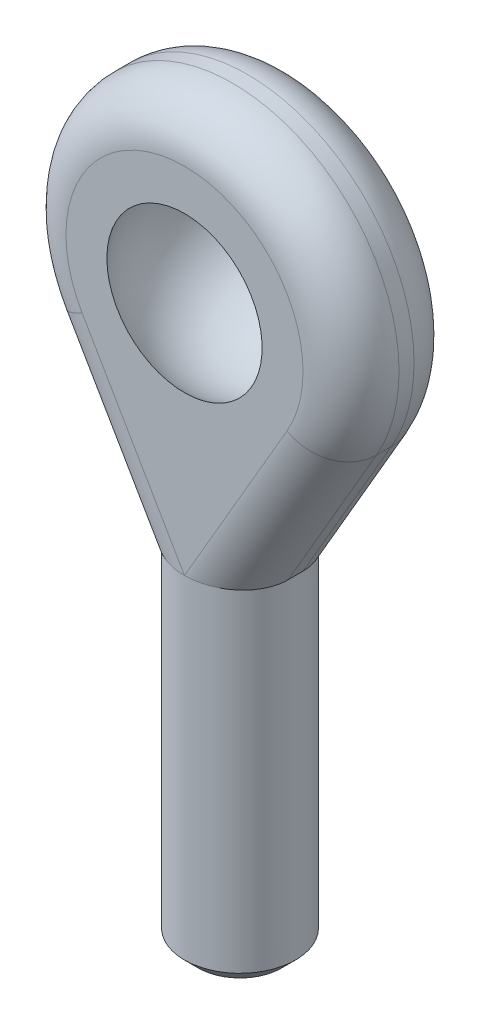
ISO-10303-21;
HEADER;
FILE_DESCRIPTION(('STEP AP214'),'2;1');
FILE_NAME('part.step','',(''),(''),'','','');
FILE_SCHEMA(('AUTOMOTIVE_DESIGN { 1 0 10303 214 1 1 1 1 }'));
ENDSEC;
DATA;
#1=APPLICATION_CONTEXT('core data for automotive mechanical design processes');
#2=APPLICATION_PROTOCOL_DEFINITION('international standard','automotive_design',2000,#1);
#3=PRODUCT_CONTEXT('',#1,'mechanical');
#4=PRODUCT('Part','Part','',(#3));
#5=PRODUCT_RELATED_PRODUCT_CATEGORY('part','',(#4));
#6=PRODUCT_DEFINITION_FORMATION('','',#4);
#7=PRODUCT_DEFINITION_CONTEXT('part definition',#1,'design');
#8=PRODUCT_DEFINITION('design','',#6,#7);
#9=PRODUCT_DEFINITION_SHAPE('','',#8);
#10=(LENGTH_UNIT() NAMED_UNIT(*) SI_UNIT(.MILLI.,.METRE.));
#11=(NAMED_UNIT(*) PLANE_ANGLE_UNIT() SI_UNIT($,.RADIAN.));
#12=(NAMED_UNIT(*) SI_UNIT($,.STERADIAN.) SOLID_ANGLE_UNIT());
#13=UNCERTAINTY_MEASURE_WITH_UNIT(LENGTH_MEASURE(1.E-05),#10,'distance_accuracy_value','');
#14=(GEOMETRIC_REPRESENTATION_CONTEXT(3) GLOBAL_UNCERTAINTY_ASSIGNED_CONTEXT((#13)) GLOBAL_UNIT_ASSIGNED_CONTEXT((#10,
#11,#12)) REPRESENTATION_CONTEXT('',''));
#15=CARTESIAN_POINT('',(0.,0.,0.));
#16=DIRECTION('',(0.,0.,1.));
#17=DIRECTION('',(1.,0.,0.));
#18=AXIS2_PLACEMENT_3D('',#15,#16,#17);
#19=CARTESIAN_POINT('',(0.,12.5,0.));
#20=DIRECTION('',(0.,-1.,0.));
#21=DIRECTION('',(0.,0.,-1.));
#22=AXIS2_PLACEMENT_3D('',#19,#20,#21);
#23=CYLINDRICAL_SURFACE('',#22,4.);
#24=CARTESIAN_POINT('',(0.,-11.5,0.));
#25=DIRECTION('',(0.,1.,0.));
#26=DIRECTION('',(0.,0.,1.));
#27=AXIS2_PLACEMENT_3D('',#24,#25,#26);
#28=CIRCLE('',#27,4.);
#29=CARTESIAN_POINT('',(0.,-11.5,4.));
#30=VERTEX_POINT('',#29);
#31=EDGE_CURVE('E156',#30,#30,#28,.T.);
#32=ORIENTED_EDGE('',*,*,#31,.T.);
#33=EDGE_LOOP('',(#32));
#34=FACE_BOUND('',#33,.T.);
#35=CARTESIAN_POINT('',(0.,12.5,0.));
#36=DIRECTION('',(0.,1.,0.));
#37=DIRECTION('',(0.,0.,1.));
#38=AXIS2_PLACEMENT_3D('',#35,#36,#37);
#39=CIRCLE('',#38,4.);
#40=CARTESIAN_POINT('',(0.,12.5,4.));
#41=VERTEX_POINT('',#40);
#42=CARTESIAN_POINT('',(4.2747447304662E-05,12.5,3.99999999988579));
#43=VERTEX_POINT('',#42);
#44=EDGE_CURVE('E171',#41,#43,#39,.T.);
#45=ORIENTED_EDGE('',*,*,#44,.F.);
#46=DIRECTION('',(1.,0.,0.));
#47=VECTOR('',#46,1.);
#48=CARTESIAN_POINT('',(4.,12.5,4.));
#49=LINE('',#48,#47);
#50=CARTESIAN_POINT('',(-4.27474473090107E-05,12.5,3.99999999988579));
#51=VERTEX_POINT('',#50);
#52=EDGE_CURVE('E241',#51,#41,#49,.T.);
#53=ORIENTED_EDGE('',*,*,#52,.F.);
#54=CARTESIAN_POINT('',(-4.,12.5,0.));
#55=VERTEX_POINT('',#54);
#56=EDGE_CURVE('E119',#55,#51,#39,.T.);
#57=ORIENTED_EDGE('',*,*,#56,.F.);
#58=CARTESIAN_POINT('',(-4.27474473081902E-05,12.5,-3.99999999988579));
#59=VERTEX_POINT('',#58);
#60=EDGE_CURVE('E152',#59,#55,#39,.T.);
#61=ORIENTED_EDGE('',*,*,#60,.F.);
#62=CARTESIAN_POINT('',(0.,12.5,-4.));
#63=VERTEX_POINT('',#62);
#64=EDGE_CURVE('E148',#63,#59,#39,.T.);
#65=ORIENTED_EDGE('',*,*,#64,.F.);
#66=DIRECTION('',(1.,0.,0.));
#67=VECTOR('',#66,1.);
#68=CARTESIAN_POINT('',(4.,12.5,-4.));
#69=LINE('',#68,#67);
#70=CARTESIAN_POINT('',(4.27474473056231E-05,12.5,-3.99999999988579));
#71=VERTEX_POINT('',#70);
#72=EDGE_CURVE('E226',#63,#71,#69,.T.);
#73=ORIENTED_EDGE('',*,*,#72,.T.);
#74=CARTESIAN_POINT('',(4.,12.5,0.));
#75=VERTEX_POINT('',#74);
#76=EDGE_CURVE('E151',#75,#71,#39,.T.);
#77=ORIENTED_EDGE('',*,*,#76,.F.);
#78=EDGE_CURVE('E174',#43,#75,#39,.T.);
#79=ORIENTED_EDGE('',*,*,#78,.F.);
#80=EDGE_LOOP('',(#45,#53,#57,#61,#65,#73,#77,#79));
#81=FACE_BOUND('',#80,.T.);
#82=ADVANCED_FACE('F43',(#34,#81),#23,.T.);
#83=CARTESIAN_POINT('',(0.,-12.5,0.));
#84=DIRECTION('',(0.,1.,0.));
#85=DIRECTION('',(0.,0.,1.));
#86=AXIS2_PLACEMENT_3D('',#83,#84,#85);
#87=PLANE('',#86);
#88=CARTESIAN_POINT('',(0.,-12.5,0.));
#89=DIRECTION('',(0.,1.,0.));
#90=DIRECTION('',(0.,0.,1.));
#91=AXIS2_PLACEMENT_3D('',#88,#89,#90);
#92=CIRCLE('',#91,3.);
#93=CARTESIAN_POINT('',(0.,-12.5,3.));
#94=VERTEX_POINT('',#93);
#95=EDGE_CURVE('E208',#94,#94,#92,.F.);
#96=ORIENTED_EDGE('',*,*,#95,.T.);
#97=EDGE_LOOP('',(#96));
#98=FACE_BOUND('',#97,.T.);
#99=ADVANCED_FACE('F288',(#98),#87,.F.);
#100=CARTESIAN_POINT('',(4.,12.5,4.));
#101=DIRECTION('',(0.,1.,0.));
#102=DIRECTION('',(-1.,0.,0.));
#103=AXIS2_PLACEMENT_3D('',#100,#101,#102);
#104=PLANE('',#103);
#105=DIRECTION('',(0.,0.,-1.));
#106=VECTOR('',#105,1.);
#107=CARTESIAN_POINT('',(4.,12.5,4.));
#108=LINE('',#107,#106);
#109=CARTESIAN_POINT('',(4.,12.5,0.5416));
#110=VERTEX_POINT('',#109);
#111=EDGE_CURVE('E247',#110,#75,#108,.T.);
#112=ORIENTED_EDGE('',*,*,#111,.F.);
#113=CARTESIAN_POINT('',(4.27474473041478E-05,12.5,0.5416));
#114=DIRECTION('',(0.,1.,0.));
#115=DIRECTION('',(1.,0.,0.));
#116=AXIS2_PLACEMENT_3D('',#113,#114,#115);
#117=ELLIPSE('',#116,3.99995725255269,3.4584);
#118=EDGE_CURVE('E11',#110,#43,#117,.F.);
#119=ORIENTED_EDGE('',*,*,#118,.T.);
#120=ORIENTED_EDGE('',*,*,#78,.T.);
#121=EDGE_LOOP('',(#112,#119,#120));
#122=FACE_BOUND('',#121,.T.);
#123=ADVANCED_FACE('F246',(#122),#104,.F.);
#124=ORIENTED_EDGE('',*,*,#76,.T.);
#125=CARTESIAN_POINT('',(4.27474473063162E-05,12.5,-0.5416));
#126=DIRECTION('',(0.,1.,0.));
#127=DIRECTION('',(-1.,0.,0.));
#128=AXIS2_PLACEMENT_3D('',#125,#126,#127);
#129=ELLIPSE('',#128,3.99995725255269,3.4584);
#130=CARTESIAN_POINT('',(4.,12.5,-0.5416));
#131=VERTEX_POINT('',#130);
#132=EDGE_CURVE('E86',#71,#131,#129,.F.);
#133=ORIENTED_EDGE('',*,*,#132,.T.);
#134=EDGE_CURVE('E251',#75,#131,#108,.T.);
#135=ORIENTED_EDGE('',*,*,#134,.F.);
#136=EDGE_LOOP('',(#124,#133,#135));
#137=FACE_BOUND('',#136,.T.);
#138=ADVANCED_FACE('F374',(#137),#104,.F.);
#139=DIRECTION('',(0.,0.,-1.));
#140=VECTOR('',#139,1.);
#141=CARTESIAN_POINT('',(-4.,12.5,4.));
#142=LINE('',#141,#140);
#143=CARTESIAN_POINT('',(-4.,12.5,-0.5416));
#144=VERTEX_POINT('',#143);
#145=EDGE_CURVE('E130',#55,#144,#142,.T.);
#146=ORIENTED_EDGE('',*,*,#145,.T.);
#147=CARTESIAN_POINT('',(-4.27474473102193E-05,12.5,-0.5416));
#148=DIRECTION('',(0.,1.,0.));
#149=DIRECTION('',(-1.,0.,0.));
#150=AXIS2_PLACEMENT_3D('',#147,#148,#149);
#151=ELLIPSE('',#150,3.99995725255269,3.4584);
#152=EDGE_CURVE('E53',#144,#59,#151,.F.);
#153=ORIENTED_EDGE('',*,*,#152,.T.);
#154=ORIENTED_EDGE('',*,*,#60,.T.);
#155=EDGE_LOOP('',(#146,#153,#154));
#156=FACE_BOUND('',#155,.T.);
#157=ADVANCED_FACE('F367',(#156),#104,.F.);
#158=ORIENTED_EDGE('',*,*,#56,.T.);
#159=CARTESIAN_POINT('',(-4.27474473102193E-05,12.5,0.5416));
#160=DIRECTION('',(0.,1.,0.));
#161=DIRECTION('',(1.,0.,0.));
#162=AXIS2_PLACEMENT_3D('',#159,#160,#161);
#163=ELLIPSE('',#162,3.99995725255269,3.4584);
#164=CARTESIAN_POINT('',(-4.,12.5,0.5416));
#165=VERTEX_POINT('',#164);
#166=EDGE_CURVE('E113',#51,#165,#163,.F.);
#167=ORIENTED_EDGE('',*,*,#166,.T.);
#168=EDGE_CURVE('E117',#165,#55,#142,.T.);
#169=ORIENTED_EDGE('',*,*,#168,.T.);
#170=EDGE_LOOP('',(#158,#167,#169));
#171=FACE_BOUND('',#170,.T.);
#172=ADVANCED_FACE('F115',(#171),#104,.F.);
#173=CARTESIAN_POINT('',(0.,29.5,4.));
#174=DIRECTION('',(0.,0.,-1.));
#175=DIRECTION('',(-1.,0.,0.));
#176=AXIS2_PLACEMENT_3D('',#173,#174,#175);
#177=CYLINDRICAL_SURFACE('',#176,12.);
#178=DIRECTION('',(0.,0.,-1.));
#179=VECTOR('',#178,1.);
#180=CARTESIAN_POINT('',(10.3753108795138,23.470661383415,4.));
#181=LINE('',#180,#179);
#182=CARTESIAN_POINT('',(10.3753108795138,23.470661383415,0.5416));
#183=VERTEX_POINT('',#182);
#184=CARTESIAN_POINT('',(10.3753108795138,23.470661383415,-0.5416));
#185=VERTEX_POINT('',#184);
#186=EDGE_CURVE('E254',#183,#185,#181,.T.);
#187=ORIENTED_EDGE('',*,*,#186,.T.);
#188=CARTESIAN_POINT('',(0.,29.5,-0.5416));
#189=DIRECTION('',(0.,0.,-1.));
#190=DIRECTION('',(-1.,0.,0.));
#191=AXIS2_PLACEMENT_3D('',#188,#189,#190);
#192=CIRCLE('',#191,12.);
#193=CARTESIAN_POINT('',(-10.3753108795138,23.470661383415,-0.5416));
#194=VERTEX_POINT('',#193);
#195=EDGE_CURVE('E218',#185,#194,#192,.F.);
#196=ORIENTED_EDGE('',*,*,#195,.T.);
#197=DIRECTION('',(0.,0.,-1.));
#198=VECTOR('',#197,1.);
#199=CARTESIAN_POINT('',(-10.3753108795138,23.470661383415,4.));
#200=LINE('',#199,#198);
#201=CARTESIAN_POINT('',(-10.3753108795138,23.470661383415,0.5416));
#202=VERTEX_POINT('',#201);
#203=EDGE_CURVE('E131',#202,#194,#200,.T.);
#204=ORIENTED_EDGE('',*,*,#203,.F.);
#205=CARTESIAN_POINT('',(0.,29.5,0.5416));
#206=DIRECTION('',(0.,0.,-1.));
#207=DIRECTION('',(-1.,0.,0.));
#208=AXIS2_PLACEMENT_3D('',#205,#206,#207);
#209=CIRCLE('',#208,12.);
#210=EDGE_CURVE('E195',#202,#183,#209,.T.);
#211=ORIENTED_EDGE('',*,*,#210,.T.);
#212=EDGE_LOOP('',(#187,#196,#204,#211));
#213=FACE_BOUND('',#212,.T.);
#214=ADVANCED_FACE('F354',(#213),#177,.T.);
#215=CARTESIAN_POINT('',(-10.3753108795138,23.470661383415,4.));
#216=DIRECTION('',(0.864609239959481,0.502444884715416,0.));
#217=DIRECTION('',(-0.502444884715416,0.864609239959481,0.));
#218=AXIS2_PLACEMENT_3D('',#215,#216,#217);
#219=PLANE('',#218);
#220=ORIENTED_EDGE('',*,*,#168,.F.);
#221=DIRECTION('',(0.502444884715416,-0.864609239959481,0.));
#222=VECTOR('',#221,1.);
#223=CARTESIAN_POINT('',(-10.3753108795138,23.470661383415,0.5416));
#224=LINE('',#223,#222);
#225=EDGE_CURVE('E128',#165,#202,#224,.F.);
#226=ORIENTED_EDGE('',*,*,#225,.T.);
#227=ORIENTED_EDGE('',*,*,#203,.T.);
#228=DIRECTION('',(0.502444884715416,-0.864609239959481,0.));
#229=VECTOR('',#228,1.);
#230=CARTESIAN_POINT('',(-4.,12.5,-0.5416));
#231=LINE('',#230,#229);
#232=EDGE_CURVE('E62',#194,#144,#231,.T.);
#233=ORIENTED_EDGE('',*,*,#232,.T.);
#234=ORIENTED_EDGE('',*,*,#145,.F.);
#235=EDGE_LOOP('',(#220,#226,#227,#233,#234));
#236=FACE_BOUND('',#235,.T.);
#237=ADVANCED_FACE('F127',(#236),#219,.F.);
#238=CARTESIAN_POINT('',(4.,12.5,4.));
#239=DIRECTION('',(-0.864609239959481,0.502444884715416,0.));
#240=DIRECTION('',(-0.502444884715416,-0.864609239959481,0.));
#241=AXIS2_PLACEMENT_3D('',#238,#239,#240);
#242=PLANE('',#241);
#243=ORIENTED_EDGE('',*,*,#134,.T.);
#244=DIRECTION('',(0.502444884715416,0.864609239959481,0.));
#245=VECTOR('',#244,1.);
#246=CARTESIAN_POINT('',(10.3753108795138,23.470661383415,-0.5416));
#247=LINE('',#246,#245);
#248=EDGE_CURVE('E145',#131,#185,#247,.T.);
#249=ORIENTED_EDGE('',*,*,#248,.T.);
#250=ORIENTED_EDGE('',*,*,#186,.F.);
#251=DIRECTION('',(0.502444884715416,0.864609239959481,0.));
#252=VECTOR('',#251,1.);
#253=CARTESIAN_POINT('',(4.,12.5,0.5416));
#254=LINE('',#253,#252);
#255=EDGE_CURVE('E203',#183,#110,#254,.F.);
#256=ORIENTED_EDGE('',*,*,#255,.T.);
#257=ORIENTED_EDGE('',*,*,#111,.T.);
#258=EDGE_LOOP('',(#243,#249,#250,#256,#257));
#259=FACE_BOUND('',#258,.T.);
#260=ADVANCED_FACE('F250',(#259),#242,.F.);
#261=CARTESIAN_POINT('',(0.,29.5,4.));
#262=DIRECTION('',(0.,0.,-1.));
#263=DIRECTION('',(-1.,0.,0.));
#264=AXIS2_PLACEMENT_3D('',#261,#262,#263);
#265=PLANE('',#264);
#266=CARTESIAN_POINT('',(0.,29.5,4.));
#267=DIRECTION('',(0.,0.,-1.));
#268=DIRECTION('',(-1.,0.,0.));
#269=AXIS2_PLACEMENT_3D('',#266,#267,#268);
#270=CIRCLE('',#269,5.5937465083788);
#271=CARTESIAN_POINT('',(-5.5937465083788,29.5,4.));
#272=VERTEX_POINT('',#271);
#273=EDGE_CURVE('E261',#272,#272,#270,.F.);
#274=ORIENTED_EDGE('',*,*,#273,.F.);
#275=EDGE_LOOP('',(#274));
#276=FACE_BOUND('',#275,.T.);
#277=CARTESIAN_POINT('',(0.,29.5,4.));
#278=DIRECTION('',(0.,0.,-1.));
#279=DIRECTION('',(-1.,0.,0.));
#280=AXIS2_PLACEMENT_3D('',#277,#278,#279);
#281=CIRCLE('',#280,8.5416);
#282=CARTESIAN_POINT('',(7.38514628403791,25.2083167727148,4.));
#283=VERTEX_POINT('',#282);
#284=CARTESIAN_POINT('',(-7.38514628403791,25.2083167727148,4.));
#285=VERTEX_POINT('',#284);
#286=EDGE_CURVE('E196',#283,#285,#281,.F.);
#287=ORIENTED_EDGE('',*,*,#286,.T.);
#288=DIRECTION('',(0.502444884715416,-0.864609239959481,0.));
#289=VECTOR('',#288,1.);
#290=CARTESIAN_POINT('',(-7.38514628403791,25.2083167727148,4.));
#291=LINE('',#290,#289);
#292=EDGE_CURVE('E125',#285,#51,#291,.T.);
#293=ORIENTED_EDGE('',*,*,#292,.T.);
#294=ORIENTED_EDGE('',*,*,#52,.T.);
#295=ORIENTED_EDGE('',*,*,#44,.T.);
#296=DIRECTION('',(0.502444884715416,0.864609239959481,0.));
#297=VECTOR('',#296,1.);
#298=CARTESIAN_POINT('',(7.38514628403791,25.2083167727148,4.));
#299=LINE('',#298,#297);
#300=EDGE_CURVE('E202',#43,#283,#299,.T.);
#301=ORIENTED_EDGE('',*,*,#300,.T.);
#302=EDGE_LOOP('',(#287,#293,#294,#295,#301));
#303=FACE_BOUND('',#302,.T.);
#304=ADVANCED_FACE('F236',(#276,#303),#265,.F.);
#305=CARTESIAN_POINT('',(0.,29.5,-4.));
#306=DIRECTION('',(0.,0.,-1.));
#307=DIRECTION('',(-1.,0.,0.));
#308=AXIS2_PLACEMENT_3D('',#305,#306,#307);
#309=PLANE('',#308);
#310=CARTESIAN_POINT('',(0.,29.5,-4.));
#311=DIRECTION('',(0.,0.,-1.));
#312=DIRECTION('',(-1.,0.,0.));
#313=AXIS2_PLACEMENT_3D('',#310,#311,#312);
#314=CIRCLE('',#313,5.59374650837879);
#315=CARTESIAN_POINT('',(-5.59374650837879,29.5,-4.));
#316=VERTEX_POINT('',#315);
#317=EDGE_CURVE('E186',#316,#316,#314,.F.);
#318=ORIENTED_EDGE('',*,*,#317,.T.);
#319=EDGE_LOOP('',(#318));
#320=FACE_BOUND('',#319,.T.);
#321=CARTESIAN_POINT('',(0.,29.5,-4.));
#322=DIRECTION('',(0.,0.,-1.));
#323=DIRECTION('',(-1.,0.,0.));
#324=AXIS2_PLACEMENT_3D('',#321,#322,#323);
#325=CIRCLE('',#324,8.5416);
#326=CARTESIAN_POINT('',(-7.38514628403791,25.2083167727148,-4.));
#327=VERTEX_POINT('',#326);
#328=CARTESIAN_POINT('',(7.38514628403791,25.2083167727148,-4.));
#329=VERTEX_POINT('',#328);
#330=EDGE_CURVE('E144',#327,#329,#325,.T.);
#331=ORIENTED_EDGE('',*,*,#330,.T.);
#332=DIRECTION('',(0.502444884715416,0.864609239959481,0.));
#333=VECTOR('',#332,1.);
#334=CARTESIAN_POINT('',(1.00983540452413,14.2376553892998,-4.));
#335=LINE('',#334,#333);
#336=EDGE_CURVE('E216',#329,#71,#335,.F.);
#337=ORIENTED_EDGE('',*,*,#336,.T.);
#338=ORIENTED_EDGE('',*,*,#72,.F.);
#339=ORIENTED_EDGE('',*,*,#64,.T.);
#340=DIRECTION('',(0.502444884715416,-0.864609239959481,0.));
#341=VECTOR('',#340,1.);
#342=CARTESIAN_POINT('',(-7.38514628403791,25.2083167727148,-4.));
#343=LINE('',#342,#341);
#344=EDGE_CURVE('E142',#59,#327,#343,.F.);
#345=ORIENTED_EDGE('',*,*,#344,.T.);
#346=EDGE_LOOP('',(#331,#337,#338,#339,#345));
#347=FACE_BOUND('',#346,.T.);
#348=ADVANCED_FACE('F270',(#320,#347),#309,.T.);
#349=CARTESIAN_POINT('',(0.,-11.5,0.));
#350=DIRECTION('',(0.,1.,0.));
#351=DIRECTION('',(0.,0.,1.));
#352=AXIS2_PLACEMENT_3D('',#349,#350,#351);
#353=CONICAL_SURFACE('',#352,4.,0.785398163397448);
#354=ORIENTED_EDGE('',*,*,#95,.F.);
#355=EDGE_LOOP('',(#354));
#356=FACE_BOUND('',#355,.T.);
#357=ORIENTED_EDGE('',*,*,#31,.F.);
#358=EDGE_LOOP('',(#357));
#359=FACE_BOUND('',#358,.T.);
#360=ADVANCED_FACE('F275',(#356,#359),#353,.T.);
#361=CARTESIAN_POINT('',(0.,29.5,0.));
#362=DIRECTION('',(0.,0.,1.));
#363=DIRECTION('',(0.,1.,0.));
#364=AXIS2_PLACEMENT_3D('',#361,#362,#363);
#365=SPHERICAL_SURFACE('',#364,6.87677249878168);
#366=ORIENTED_EDGE('',*,*,#317,.F.);
#367=EDGE_LOOP('',(#366));
#368=FACE_BOUND('',#367,.T.);
#369=ORIENTED_EDGE('',*,*,#273,.T.);
#370=EDGE_LOOP('',(#369));
#371=FACE_BOUND('',#370,.T.);
#372=ADVANCED_FACE('F272',(#368,#371),#365,.F.);
#373=CARTESIAN_POINT('',(-7.38514628403791,25.2083167727148,-0.5416));
#374=DIRECTION('',(-0.502444884715416,0.864609239959481,0.));
#375=DIRECTION('',(-0.864609239959481,-0.502444884715416,0.));
#376=AXIS2_PLACEMENT_3D('',#373,#374,#375);
#377=CYLINDRICAL_SURFACE('',#376,3.4584);
#378=ORIENTED_EDGE('',*,*,#152,.F.);
#379=ORIENTED_EDGE('',*,*,#232,.F.);
#380=CARTESIAN_POINT('',(-7.38514628403791,25.2083167727148,-0.5416));
#381=DIRECTION('',(-0.502444884715416,0.864609239959481,0.));
#382=DIRECTION('',(-0.864609239959481,-0.502444884715416,0.));
#383=AXIS2_PLACEMENT_3D('',#380,#381,#382);
#384=CIRCLE('',#383,3.4584);
#385=EDGE_CURVE('E184',#327,#194,#384,.T.);
#386=ORIENTED_EDGE('',*,*,#385,.F.);
#387=ORIENTED_EDGE('',*,*,#344,.F.);
#388=EDGE_LOOP('',(#378,#379,#386,#387));
#389=FACE_BOUND('',#388,.T.);
#390=ADVANCED_FACE('F274',(#389),#377,.T.);
#391=CARTESIAN_POINT('',(0.,29.5,-0.5416));
#392=DIRECTION('',(0.,0.,-1.));
#393=DIRECTION('',(-1.,0.,0.));
#394=AXIS2_PLACEMENT_3D('',#391,#392,#393);
#395=TOROIDAL_SURFACE('',#394,8.5416,3.4584);
#396=ORIENTED_EDGE('',*,*,#385,.T.);
#397=ORIENTED_EDGE('',*,*,#195,.F.);
#398=CARTESIAN_POINT('',(7.38514628403791,25.2083167727148,-0.5416));
#399=DIRECTION('',(-0.502444884715416,-0.864609239959481,0.));
#400=DIRECTION('',(0.864609239959481,-0.502444884715416,0.));
#401=AXIS2_PLACEMENT_3D('',#398,#399,#400);
#402=CIRCLE('',#401,3.4584);
#403=EDGE_CURVE('E181',#329,#185,#402,.T.);
#404=ORIENTED_EDGE('',*,*,#403,.F.);
#405=ORIENTED_EDGE('',*,*,#330,.F.);
#406=EDGE_LOOP('',(#396,#397,#404,#405));
#407=FACE_BOUND('',#406,.T.);
#408=ADVANCED_FACE('F282',(#407),#395,.T.);
#409=CARTESIAN_POINT('',(1.00983540452413,14.2376553892998,-0.5416));
#410=DIRECTION('',(-0.502444884715416,-0.864609239959481,0.));
#411=DIRECTION('',(0.864609239959481,-0.502444884715416,0.));
#412=AXIS2_PLACEMENT_3D('',#409,#410,#411);
#413=CYLINDRICAL_SURFACE('',#412,3.4584);
#414=ORIENTED_EDGE('',*,*,#132,.F.);
#415=ORIENTED_EDGE('',*,*,#336,.F.);
#416=ORIENTED_EDGE('',*,*,#403,.T.);
#417=ORIENTED_EDGE('',*,*,#248,.F.);
#418=EDGE_LOOP('',(#414,#415,#416,#417));
#419=FACE_BOUND('',#418,.T.);
#420=ADVANCED_FACE('F303',(#419),#413,.T.);
#421=CARTESIAN_POINT('',(7.38514628403791,25.2083167727148,0.5416));
#422=DIRECTION('',(0.502444884715416,0.864609239959481,0.));
#423=DIRECTION('',(-0.864609239959481,0.502444884715416,0.));
#424=AXIS2_PLACEMENT_3D('',#421,#422,#423);
#425=CYLINDRICAL_SURFACE('',#424,3.4584);
#426=ORIENTED_EDGE('',*,*,#118,.F.);
#427=ORIENTED_EDGE('',*,*,#255,.F.);
#428=CARTESIAN_POINT('',(7.38514628403791,25.2083167727148,0.5416));
#429=DIRECTION('',(0.502444884715416,0.864609239959481,0.));
#430=DIRECTION('',(-0.864609239959481,0.502444884715416,0.));
#431=AXIS2_PLACEMENT_3D('',#428,#429,#430);
#432=CIRCLE('',#431,3.4584);
#433=EDGE_CURVE('E47',#283,#183,#432,.T.);
#434=ORIENTED_EDGE('',*,*,#433,.F.);
#435=ORIENTED_EDGE('',*,*,#300,.F.);
#436=EDGE_LOOP('',(#426,#427,#434,#435));
#437=FACE_BOUND('',#436,.T.);
#438=ADVANCED_FACE('F45',(#437),#425,.T.);
#439=CARTESIAN_POINT('',(0.,29.5,0.5416));
#440=DIRECTION('',(0.,0.,-1.));
#441=DIRECTION('',(-1.,0.,0.));
#442=AXIS2_PLACEMENT_3D('',#439,#440,#441);
#443=TOROIDAL_SURFACE('',#442,8.5416,3.4584);
#444=ORIENTED_EDGE('',*,*,#433,.T.);
#445=ORIENTED_EDGE('',*,*,#210,.F.);
#446=CARTESIAN_POINT('',(-7.38514628403791,25.2083167727148,0.5416));
#447=DIRECTION('',(0.502444884715416,-0.864609239959481,0.));
#448=DIRECTION('',(0.864609239959481,0.502444884715416,0.));
#449=AXIS2_PLACEMENT_3D('',#446,#447,#448);
#450=CIRCLE('',#449,3.4584);
#451=EDGE_CURVE('E136',#285,#202,#450,.T.);
#452=ORIENTED_EDGE('',*,*,#451,.F.);
#453=ORIENTED_EDGE('',*,*,#286,.F.);
#454=EDGE_LOOP('',(#444,#445,#452,#453));
#455=FACE_BOUND('',#454,.T.);
#456=ADVANCED_FACE('F193',(#455),#443,.T.);
#457=CARTESIAN_POINT('',(-7.38514628403791,25.2083167727148,0.5416));
#458=DIRECTION('',(0.502444884715416,-0.864609239959481,0.));
#459=DIRECTION('',(0.864609239959481,0.502444884715416,0.));
#460=AXIS2_PLACEMENT_3D('',#457,#458,#459);
#461=CYLINDRICAL_SURFACE('',#460,3.4584);
#462=ORIENTED_EDGE('',*,*,#451,.T.);
#463=ORIENTED_EDGE('',*,*,#225,.F.);
#464=ORIENTED_EDGE('',*,*,#166,.F.);
#465=ORIENTED_EDGE('',*,*,#292,.F.);
#466=EDGE_LOOP('',(#462,#463,#464,#465));
#467=FACE_BOUND('',#466,.T.);
#468=ADVANCED_FACE('F134',(#467),#461,.T.);
#469=CLOSED_SHELL('',(#82,#99,#123,#138,#157,#172,#214,#237,#260,#304,#348,#360,#372,#390,#408,
#420,#438,#456,#468));
#470=MANIFOLD_SOLID_BREP('B2',#469);
#471=ADVANCED_BREP_SHAPE_REPRESENTATION('',(#18,#470),#14);
#472=SHAPE_DEFINITION_REPRESENTATION(#9,#471);
ENDSEC;
END-ISO-10303-21;
